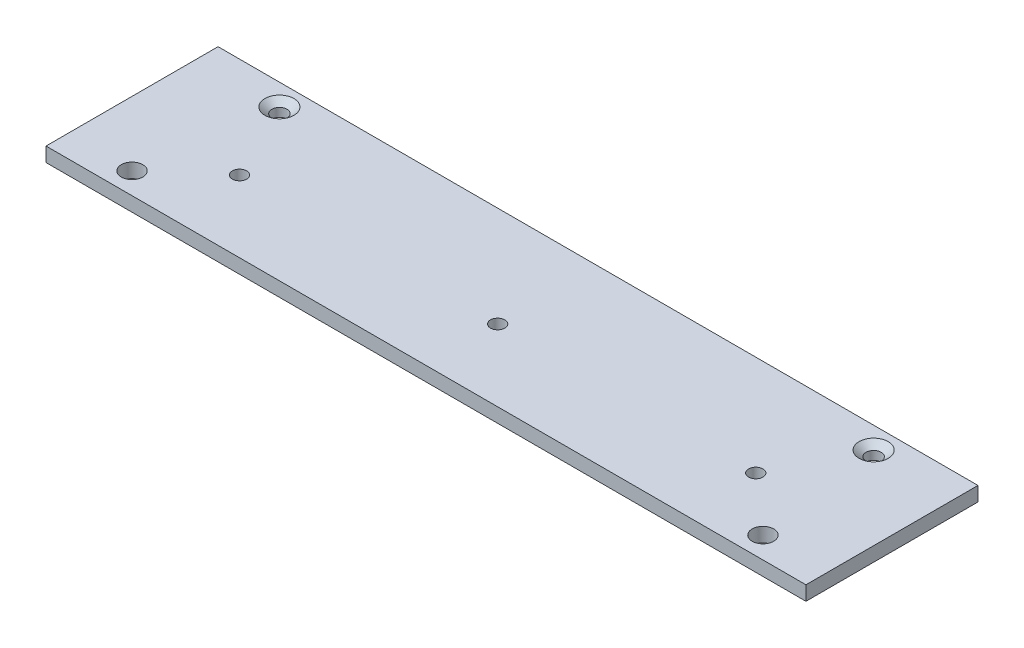
ISO-10303-21;
HEADER;
FILE_DESCRIPTION(('STEP AP214'),'2;1');
FILE_NAME('part.step','',(''),(''),'','','');
FILE_SCHEMA(('AUTOMOTIVE_DESIGN { 1 0 10303 214 1 1 1 1 }'));
ENDSEC;
DATA;
#1=APPLICATION_CONTEXT('core data for automotive mechanical design processes');
#2=APPLICATION_PROTOCOL_DEFINITION('international standard','automotive_design',2000,#1);
#3=PRODUCT_CONTEXT('',#1,'mechanical');
#4=PRODUCT('Part','Part','',(#3));
#5=PRODUCT_RELATED_PRODUCT_CATEGORY('part','',(#4));
#6=PRODUCT_DEFINITION_FORMATION('','',#4);
#7=PRODUCT_DEFINITION_CONTEXT('part definition',#1,'design');
#8=PRODUCT_DEFINITION('design','',#6,#7);
#9=PRODUCT_DEFINITION_SHAPE('','',#8);
#10=(LENGTH_UNIT() NAMED_UNIT(*) SI_UNIT(.MILLI.,.METRE.));
#11=(NAMED_UNIT(*) PLANE_ANGLE_UNIT() SI_UNIT($,.RADIAN.));
#12=(NAMED_UNIT(*) SI_UNIT($,.STERADIAN.) SOLID_ANGLE_UNIT());
#13=UNCERTAINTY_MEASURE_WITH_UNIT(LENGTH_MEASURE(1.E-05),#10,'distance_accuracy_value','');
#14=(GEOMETRIC_REPRESENTATION_CONTEXT(3) GLOBAL_UNCERTAINTY_ASSIGNED_CONTEXT((#13)) GLOBAL_UNIT_ASSIGNED_CONTEXT((#10,
#11,#12)) REPRESENTATION_CONTEXT('',''));
#15=CARTESIAN_POINT('',(0.,0.,0.));
#16=DIRECTION('',(0.,0.,1.));
#17=DIRECTION('',(1.,0.,0.));
#18=AXIS2_PLACEMENT_3D('',#15,#16,#17);
#19=CARTESIAN_POINT('',(0.,3.175,0.));
#20=DIRECTION('',(0.,1.,0.));
#21=DIRECTION('',(0.,0.,1.));
#22=AXIS2_PLACEMENT_3D('',#19,#20,#21);
#23=PLANE('',#22);
#24=CARTESIAN_POINT('',(-114.3,3.175,-6.35000000000002));
#25=DIRECTION('',(0.,1.,0.));
#26=DIRECTION('',(0.,0.,1.));
#27=AXIS2_PLACEMENT_3D('',#24,#25,#26);
#28=CIRCLE('',#27,3.175);
#29=CARTESIAN_POINT('',(-114.3,3.175,-3.17500000000002));
#30=VERTEX_POINT('',#29);
#31=EDGE_CURVE('E143',#30,#30,#28,.T.);
#32=ORIENTED_EDGE('',*,*,#31,.F.);
#33=EDGE_LOOP('',(#32));
#34=FACE_BOUND('',#33,.T.);
#35=CARTESIAN_POINT('',(114.3,3.175,-6.35000000000002));
#36=DIRECTION('',(0.,1.,0.));
#37=DIRECTION('',(0.,0.,1.));
#38=AXIS2_PLACEMENT_3D('',#35,#36,#37);
#39=CIRCLE('',#38,3.175);
#40=CARTESIAN_POINT('',(114.3,3.175,-3.17500000000002));
#41=VERTEX_POINT('',#40);
#42=EDGE_CURVE('E146',#41,#41,#39,.T.);
#43=ORIENTED_EDGE('',*,*,#42,.F.);
#44=EDGE_LOOP('',(#43));
#45=FACE_BOUND('',#44,.T.);
#46=CARTESIAN_POINT('',(0.,3.175,-6.35000000000002));
#47=DIRECTION('',(0.,1.,0.));
#48=DIRECTION('',(0.,0.,1.));
#49=AXIS2_PLACEMENT_3D('',#46,#47,#48);
#50=CIRCLE('',#49,3.175);
#51=CARTESIAN_POINT('',(0.,3.175,-3.17500000000002));
#52=VERTEX_POINT('',#51);
#53=EDGE_CURVE('E149',#52,#52,#50,.T.);
#54=ORIENTED_EDGE('',*,*,#53,.F.);
#55=EDGE_LOOP('',(#54));
#56=FACE_BOUND('',#55,.T.);
#57=CARTESIAN_POINT('',(-131.572,3.175,-41.2750000000001));
#58=DIRECTION('',(0.,1.,0.));
#59=DIRECTION('',(0.,0.,1.));
#60=AXIS2_PLACEMENT_3D('',#57,#58,#59);
#61=CIRCLE('',#60,6.4389);
#62=CARTESIAN_POINT('',(-131.572,3.175,-34.8361000000001));
#63=VERTEX_POINT('',#62);
#64=EDGE_CURVE('E140',#63,#63,#61,.T.);
#65=ORIENTED_EDGE('',*,*,#64,.F.);
#66=EDGE_LOOP('',(#65));
#67=FACE_BOUND('',#66,.T.);
#68=CARTESIAN_POINT('',(131.572,3.175,-41.2750000000001));
#69=DIRECTION('',(0.,1.,0.));
#70=DIRECTION('',(0.,0.,1.));
#71=AXIS2_PLACEMENT_3D('',#68,#69,#70);
#72=CIRCLE('',#71,6.4389);
#73=CARTESIAN_POINT('',(131.572,3.175,-34.8361000000001));
#74=VERTEX_POINT('',#73);
#75=EDGE_CURVE('E131',#74,#74,#72,.T.);
#76=ORIENTED_EDGE('',*,*,#75,.F.);
#77=EDGE_LOOP('',(#76));
#78=FACE_BOUND('',#77,.T.);
#79=CARTESIAN_POINT('',(-139.7,3.175,15.875));
#80=DIRECTION('',(0.,1.,0.));
#81=DIRECTION('',(0.,0.,1.));
#82=AXIS2_PLACEMENT_3D('',#79,#80,#81);
#83=CIRCLE('',#82,4.76250000000001);
#84=CARTESIAN_POINT('',(-139.7,3.175,20.6375));
#85=VERTEX_POINT('',#84);
#86=EDGE_CURVE('E102',#85,#85,#83,.T.);
#87=ORIENTED_EDGE('',*,*,#86,.F.);
#88=EDGE_LOOP('',(#87));
#89=FACE_BOUND('',#88,.T.);
#90=DIRECTION('',(0.,0.,-1.));
#91=VECTOR('',#90,1.);
#92=CARTESIAN_POINT('',(168.275,3.175,-50.8));
#93=LINE('',#92,#91);
#94=CARTESIAN_POINT('',(168.275,3.175,25.4));
#95=VERTEX_POINT('',#94);
#96=CARTESIAN_POINT('',(168.275,3.175,-50.8));
#97=VERTEX_POINT('',#96);
#98=EDGE_CURVE('E87',#95,#97,#93,.T.);
#99=ORIENTED_EDGE('',*,*,#98,.T.);
#100=DIRECTION('',(-1.,0.,0.));
#101=VECTOR('',#100,1.);
#102=CARTESIAN_POINT('',(-168.275,3.175,-50.8));
#103=LINE('',#102,#101);
#104=CARTESIAN_POINT('',(-168.275,3.175,-50.8));
#105=VERTEX_POINT('',#104);
#106=EDGE_CURVE('E82',#97,#105,#103,.T.);
#107=ORIENTED_EDGE('',*,*,#106,.T.);
#108=DIRECTION('',(0.,0.,1.));
#109=VECTOR('',#108,1.);
#110=CARTESIAN_POINT('',(-168.275,3.175,-50.8));
#111=LINE('',#110,#109);
#112=CARTESIAN_POINT('',(-168.275,3.175,25.4));
#113=VERTEX_POINT('',#112);
#114=EDGE_CURVE('E85',#105,#113,#111,.T.);
#115=ORIENTED_EDGE('',*,*,#114,.T.);
#116=DIRECTION('',(1.,0.,0.));
#117=VECTOR('',#116,1.);
#118=CARTESIAN_POINT('',(-168.275,3.175,25.4));
#119=LINE('',#118,#117);
#120=EDGE_CURVE('E52',#113,#95,#119,.T.);
#121=ORIENTED_EDGE('',*,*,#120,.T.);
#122=EDGE_LOOP('',(#99,#107,#115,#121));
#123=FACE_BOUND('',#122,.T.);
#124=CARTESIAN_POINT('',(139.7,3.175,15.875));
#125=DIRECTION('',(0.,1.,0.));
#126=DIRECTION('',(0.,0.,1.));
#127=AXIS2_PLACEMENT_3D('',#124,#125,#126);
#128=CIRCLE('',#127,4.76250000000001);
#129=CARTESIAN_POINT('',(139.7,3.175,20.6375));
#130=VERTEX_POINT('',#129);
#131=EDGE_CURVE('E117',#130,#130,#128,.T.);
#132=ORIENTED_EDGE('',*,*,#131,.F.);
#133=EDGE_LOOP('',(#132));
#134=FACE_BOUND('',#133,.T.);
#135=ADVANCED_FACE('F35',(#34,#45,#56,#67,#78,#89,#123,#134),#23,.T.);
#136=CARTESIAN_POINT('',(0.,-3.175,0.));
#137=DIRECTION('',(0.,1.,0.));
#138=DIRECTION('',(0.,0.,1.));
#139=AXIS2_PLACEMENT_3D('',#136,#137,#138);
#140=PLANE('',#139);
#141=CARTESIAN_POINT('',(-114.3,-3.17500000000004,-6.35000000000002));
#142=DIRECTION('',(0.,1.,0.));
#143=DIRECTION('',(0.,0.,1.));
#144=AXIS2_PLACEMENT_3D('',#141,#142,#143);
#145=CIRCLE('',#144,3.175);
#146=CARTESIAN_POINT('',(-114.3,-3.17500000000004,-3.17500000000002));
#147=VERTEX_POINT('',#146);
#148=EDGE_CURVE('E152',#147,#147,#145,.T.);
#149=ORIENTED_EDGE('',*,*,#148,.T.);
#150=EDGE_LOOP('',(#149));
#151=FACE_BOUND('',#150,.T.);
#152=CARTESIAN_POINT('',(114.3,-3.17500000000004,-6.35000000000002));
#153=DIRECTION('',(0.,1.,0.));
#154=DIRECTION('',(0.,0.,1.));
#155=AXIS2_PLACEMENT_3D('',#152,#153,#154);
#156=CIRCLE('',#155,3.175);
#157=CARTESIAN_POINT('',(114.3,-3.17500000000004,-3.17500000000002));
#158=VERTEX_POINT('',#157);
#159=EDGE_CURVE('E156',#158,#158,#156,.T.);
#160=ORIENTED_EDGE('',*,*,#159,.T.);
#161=EDGE_LOOP('',(#160));
#162=FACE_BOUND('',#161,.T.);
#163=CARTESIAN_POINT('',(0.,-3.17500000000004,-6.35000000000002));
#164=DIRECTION('',(0.,1.,0.));
#165=DIRECTION('',(0.,0.,1.));
#166=AXIS2_PLACEMENT_3D('',#163,#164,#165);
#167=CIRCLE('',#166,3.175);
#168=CARTESIAN_POINT('',(0.,-3.17500000000004,-3.17500000000002));
#169=VERTEX_POINT('',#168);
#170=EDGE_CURVE('E153',#169,#169,#167,.T.);
#171=ORIENTED_EDGE('',*,*,#170,.T.);
#172=EDGE_LOOP('',(#171));
#173=FACE_BOUND('',#172,.T.);
#174=CARTESIAN_POINT('',(-131.572,-3.17500000000004,-41.2750000000001));
#175=DIRECTION('',(0.,1.,0.));
#176=DIRECTION('',(0.,0.,1.));
#177=AXIS2_PLACEMENT_3D('',#174,#175,#176);
#178=CIRCLE('',#177,3.3782);
#179=CARTESIAN_POINT('',(-131.572,-3.17500000000004,-37.8968000000001));
#180=VERTEX_POINT('',#179);
#181=EDGE_CURVE('E134',#180,#180,#178,.T.);
#182=ORIENTED_EDGE('',*,*,#181,.T.);
#183=EDGE_LOOP('',(#182));
#184=FACE_BOUND('',#183,.T.);
#185=CARTESIAN_POINT('',(131.572,-3.17500000000004,-41.2750000000001));
#186=DIRECTION('',(0.,1.,0.));
#187=DIRECTION('',(0.,0.,1.));
#188=AXIS2_PLACEMENT_3D('',#185,#186,#187);
#189=CIRCLE('',#188,3.3782);
#190=CARTESIAN_POINT('',(131.572,-3.17500000000004,-37.8968000000001));
#191=VERTEX_POINT('',#190);
#192=EDGE_CURVE('E123',#191,#191,#189,.T.);
#193=ORIENTED_EDGE('',*,*,#192,.T.);
#194=EDGE_LOOP('',(#193));
#195=FACE_BOUND('',#194,.T.);
#196=DIRECTION('',(0.,0.,-1.));
#197=VECTOR('',#196,1.);
#198=CARTESIAN_POINT('',(168.275,-3.175,-50.8));
#199=LINE('',#198,#197);
#200=CARTESIAN_POINT('',(168.275,-3.175,25.4));
#201=VERTEX_POINT('',#200);
#202=CARTESIAN_POINT('',(168.275,-3.175,-50.8));
#203=VERTEX_POINT('',#202);
#204=EDGE_CURVE('E99',#201,#203,#199,.T.);
#205=ORIENTED_EDGE('',*,*,#204,.F.);
#206=DIRECTION('',(1.,0.,0.));
#207=VECTOR('',#206,1.);
#208=CARTESIAN_POINT('',(-168.275,-3.175,25.4));
#209=LINE('',#208,#207);
#210=CARTESIAN_POINT('',(-168.275,-3.175,25.4));
#211=VERTEX_POINT('',#210);
#212=EDGE_CURVE('E75',#211,#201,#209,.T.);
#213=ORIENTED_EDGE('',*,*,#212,.F.);
#214=DIRECTION('',(0.,0.,1.));
#215=VECTOR('',#214,1.);
#216=CARTESIAN_POINT('',(-168.275,-3.175,-50.8));
#217=LINE('',#216,#215);
#218=CARTESIAN_POINT('',(-168.275,-3.175,-50.8));
#219=VERTEX_POINT('',#218);
#220=EDGE_CURVE('E69',#219,#211,#217,.T.);
#221=ORIENTED_EDGE('',*,*,#220,.F.);
#222=DIRECTION('',(-1.,0.,0.));
#223=VECTOR('',#222,1.);
#224=CARTESIAN_POINT('',(-168.275,-3.175,-50.8));
#225=LINE('',#224,#223);
#226=EDGE_CURVE('E91',#203,#219,#225,.T.);
#227=ORIENTED_EDGE('',*,*,#226,.F.);
#228=EDGE_LOOP('',(#205,#213,#221,#227));
#229=FACE_BOUND('',#228,.T.);
#230=CARTESIAN_POINT('',(-139.7,-3.175,15.875));
#231=DIRECTION('',(0.,1.,0.));
#232=DIRECTION('',(0.,0.,1.));
#233=AXIS2_PLACEMENT_3D('',#230,#231,#232);
#234=CIRCLE('',#233,4.76250000000001);
#235=CARTESIAN_POINT('',(-139.7,-3.175,20.6375));
#236=VERTEX_POINT('',#235);
#237=EDGE_CURVE('E114',#236,#236,#234,.T.);
#238=ORIENTED_EDGE('',*,*,#237,.T.);
#239=EDGE_LOOP('',(#238));
#240=FACE_BOUND('',#239,.T.);
#241=CARTESIAN_POINT('',(139.7,-3.175,15.875));
#242=DIRECTION('',(0.,1.,0.));
#243=DIRECTION('',(0.,0.,1.));
#244=AXIS2_PLACEMENT_3D('',#241,#242,#243);
#245=CIRCLE('',#244,4.76250000000001);
#246=CARTESIAN_POINT('',(139.7,-3.175,20.6375));
#247=VERTEX_POINT('',#246);
#248=EDGE_CURVE('E120',#247,#247,#245,.T.);
#249=ORIENTED_EDGE('',*,*,#248,.T.);
#250=EDGE_LOOP('',(#249));
#251=FACE_BOUND('',#250,.T.);
#252=ADVANCED_FACE('F110',(#151,#162,#173,#184,#195,#229,#240,#251),#140,.F.);
#253=CARTESIAN_POINT('',(168.275,3.175,-50.8));
#254=DIRECTION('',(-1.,0.,0.));
#255=DIRECTION('',(0.,0.,1.));
#256=AXIS2_PLACEMENT_3D('',#253,#254,#255);
#257=PLANE('',#256);
#258=ORIENTED_EDGE('',*,*,#204,.T.);
#259=DIRECTION('',(0.,-1.,0.));
#260=VECTOR('',#259,1.);
#261=CARTESIAN_POINT('',(168.275,3.175,-50.8));
#262=LINE('',#261,#260);
#263=EDGE_CURVE('E11',#97,#203,#262,.T.);
#264=ORIENTED_EDGE('',*,*,#263,.F.);
#265=ORIENTED_EDGE('',*,*,#98,.F.);
#266=DIRECTION('',(0.,-1.,0.));
#267=VECTOR('',#266,1.);
#268=CARTESIAN_POINT('',(168.275,3.175,25.4));
#269=LINE('',#268,#267);
#270=EDGE_CURVE('E95',#95,#201,#269,.T.);
#271=ORIENTED_EDGE('',*,*,#270,.T.);
#272=EDGE_LOOP('',(#258,#264,#265,#271));
#273=FACE_BOUND('',#272,.T.);
#274=ADVANCED_FACE('F37',(#273),#257,.F.);
#275=CARTESIAN_POINT('',(-168.275,3.175,-50.8));
#276=DIRECTION('',(0.,0.,1.));
#277=DIRECTION('',(1.,0.,0.));
#278=AXIS2_PLACEMENT_3D('',#275,#276,#277);
#279=PLANE('',#278);
#280=ORIENTED_EDGE('',*,*,#226,.T.);
#281=DIRECTION('',(0.,-1.,0.));
#282=VECTOR('',#281,1.);
#283=CARTESIAN_POINT('',(-168.275,3.175,-50.8));
#284=LINE('',#283,#282);
#285=EDGE_CURVE('E44',#105,#219,#284,.T.);
#286=ORIENTED_EDGE('',*,*,#285,.F.);
#287=ORIENTED_EDGE('',*,*,#106,.F.);
#288=ORIENTED_EDGE('',*,*,#263,.T.);
#289=EDGE_LOOP('',(#280,#286,#287,#288));
#290=FACE_BOUND('',#289,.T.);
#291=ADVANCED_FACE('F90',(#290),#279,.F.);
#292=CARTESIAN_POINT('',(-168.275,3.175,-50.8));
#293=DIRECTION('',(1.,0.,0.));
#294=DIRECTION('',(0.,0.,-1.));
#295=AXIS2_PLACEMENT_3D('',#292,#293,#294);
#296=PLANE('',#295);
#297=ORIENTED_EDGE('',*,*,#220,.T.);
#298=DIRECTION('',(0.,-1.,0.));
#299=VECTOR('',#298,1.);
#300=CARTESIAN_POINT('',(-168.275,3.175,25.4));
#301=LINE('',#300,#299);
#302=EDGE_CURVE('E92',#113,#211,#301,.T.);
#303=ORIENTED_EDGE('',*,*,#302,.F.);
#304=ORIENTED_EDGE('',*,*,#114,.F.);
#305=ORIENTED_EDGE('',*,*,#285,.T.);
#306=EDGE_LOOP('',(#297,#303,#304,#305));
#307=FACE_BOUND('',#306,.T.);
#308=ADVANCED_FACE('F93',(#307),#296,.F.);
#309=CARTESIAN_POINT('',(-168.275,3.175,25.4));
#310=DIRECTION('',(0.,0.,-1.));
#311=DIRECTION('',(-1.,0.,0.));
#312=AXIS2_PLACEMENT_3D('',#309,#310,#311);
#313=PLANE('',#312);
#314=ORIENTED_EDGE('',*,*,#212,.T.);
#315=ORIENTED_EDGE('',*,*,#270,.F.);
#316=ORIENTED_EDGE('',*,*,#120,.F.);
#317=ORIENTED_EDGE('',*,*,#302,.T.);
#318=EDGE_LOOP('',(#314,#315,#316,#317));
#319=FACE_BOUND('',#318,.T.);
#320=ADVANCED_FACE('F107',(#319),#313,.F.);
#321=CARTESIAN_POINT('',(-139.7,3.175,15.875));
#322=DIRECTION('',(0.,-1.,0.));
#323=DIRECTION('',(0.,0.,-1.));
#324=AXIS2_PLACEMENT_3D('',#321,#322,#323);
#325=CYLINDRICAL_SURFACE('',#324,4.76250000000001);
#326=ORIENTED_EDGE('',*,*,#86,.T.);
#327=EDGE_LOOP('',(#326));
#328=FACE_BOUND('',#327,.T.);
#329=ORIENTED_EDGE('',*,*,#237,.F.);
#330=EDGE_LOOP('',(#329));
#331=FACE_BOUND('',#330,.T.);
#332=ADVANCED_FACE('F185',(#328,#331),#325,.F.);
#333=CARTESIAN_POINT('',(139.7,3.175,15.875));
#334=DIRECTION('',(0.,-1.,0.));
#335=DIRECTION('',(0.,0.,-1.));
#336=AXIS2_PLACEMENT_3D('',#333,#334,#335);
#337=CYLINDRICAL_SURFACE('',#336,4.76250000000001);
#338=ORIENTED_EDGE('',*,*,#131,.T.);
#339=EDGE_LOOP('',(#338));
#340=FACE_BOUND('',#339,.T.);
#341=ORIENTED_EDGE('',*,*,#248,.F.);
#342=EDGE_LOOP('',(#341));
#343=FACE_BOUND('',#342,.T.);
#344=ADVANCED_FACE('F255',(#340,#343),#337,.F.);
#345=CARTESIAN_POINT('',(131.572,3.175,-41.2750000000001));
#346=DIRECTION('',(0.,1.,0.));
#347=DIRECTION('',(0.,0.,1.));
#348=AXIS2_PLACEMENT_3D('',#345,#346,#347);
#349=CYLINDRICAL_SURFACE('',#348,3.3782);
#350=ORIENTED_EDGE('',*,*,#192,.F.);
#351=EDGE_LOOP('',(#350));
#352=FACE_BOUND('',#351,.T.);
#353=CARTESIAN_POINT('',(131.572,0.606767758855683,-41.2750000000001));
#354=DIRECTION('',(0.,1.,0.));
#355=DIRECTION('',(0.,0.,1.));
#356=AXIS2_PLACEMENT_3D('',#353,#354,#355);
#357=CIRCLE('',#356,3.3782);
#358=CARTESIAN_POINT('',(131.572,0.606767758855683,-37.8968000000001));
#359=VERTEX_POINT('',#358);
#360=EDGE_CURVE('E128',#359,#359,#357,.T.);
#361=ORIENTED_EDGE('',*,*,#360,.T.);
#362=EDGE_LOOP('',(#361));
#363=FACE_BOUND('',#362,.T.);
#364=ADVANCED_FACE('F247',(#352,#363),#349,.F.);
#365=CARTESIAN_POINT('',(131.572,3.175,-41.2750000000001));
#366=DIRECTION('',(0.,1.,0.));
#367=DIRECTION('',(0.,0.,1.));
#368=AXIS2_PLACEMENT_3D('',#365,#366,#367);
#369=CONICAL_SURFACE('',#368,6.4389,0.872664625997162);
#370=ORIENTED_EDGE('',*,*,#360,.F.);
#371=EDGE_LOOP('',(#370));
#372=FACE_BOUND('',#371,.T.);
#373=ORIENTED_EDGE('',*,*,#75,.T.);
#374=EDGE_LOOP('',(#373));
#375=FACE_BOUND('',#374,.T.);
#376=ADVANCED_FACE('F239',(#372,#375),#369,.F.);
#377=CARTESIAN_POINT('',(-131.572,3.175,-41.2750000000001));
#378=DIRECTION('',(0.,1.,0.));
#379=DIRECTION('',(0.,0.,1.));
#380=AXIS2_PLACEMENT_3D('',#377,#378,#379);
#381=CYLINDRICAL_SURFACE('',#380,3.3782);
#382=ORIENTED_EDGE('',*,*,#181,.F.);
#383=EDGE_LOOP('',(#382));
#384=FACE_BOUND('',#383,.T.);
#385=CARTESIAN_POINT('',(-131.572,0.606767758855683,-41.2750000000001));
#386=DIRECTION('',(0.,1.,0.));
#387=DIRECTION('',(0.,0.,1.));
#388=AXIS2_PLACEMENT_3D('',#385,#386,#387);
#389=CIRCLE('',#388,3.3782);
#390=CARTESIAN_POINT('',(-131.572,0.606767758855683,-37.8968000000001));
#391=VERTEX_POINT('',#390);
#392=EDGE_CURVE('E137',#391,#391,#389,.T.);
#393=ORIENTED_EDGE('',*,*,#392,.T.);
#394=EDGE_LOOP('',(#393));
#395=FACE_BOUND('',#394,.T.);
#396=ADVANCED_FACE('F232',(#384,#395),#381,.F.);
#397=CARTESIAN_POINT('',(-131.572,3.175,-41.2750000000001));
#398=DIRECTION('',(0.,1.,0.));
#399=DIRECTION('',(0.,0.,1.));
#400=AXIS2_PLACEMENT_3D('',#397,#398,#399);
#401=CONICAL_SURFACE('',#400,6.4389,0.872664625997162);
#402=ORIENTED_EDGE('',*,*,#392,.F.);
#403=EDGE_LOOP('',(#402));
#404=FACE_BOUND('',#403,.T.);
#405=ORIENTED_EDGE('',*,*,#64,.T.);
#406=EDGE_LOOP('',(#405));
#407=FACE_BOUND('',#406,.T.);
#408=ADVANCED_FACE('F213',(#404,#407),#401,.F.);
#409=CARTESIAN_POINT('',(0.,-3.17500000000004,-6.35000000000002));
#410=DIRECTION('',(0.,1.,0.));
#411=DIRECTION('',(0.,0.,1.));
#412=AXIS2_PLACEMENT_3D('',#409,#410,#411);
#413=CYLINDRICAL_SURFACE('',#412,3.175);
#414=ORIENTED_EDGE('',*,*,#53,.T.);
#415=EDGE_LOOP('',(#414));
#416=FACE_BOUND('',#415,.T.);
#417=ORIENTED_EDGE('',*,*,#170,.F.);
#418=EDGE_LOOP('',(#417));
#419=FACE_BOUND('',#418,.T.);
#420=ADVANCED_FACE('F172',(#416,#419),#413,.F.);
#421=CARTESIAN_POINT('',(114.3,-3.17500000000004,-6.35000000000002));
#422=DIRECTION('',(0.,1.,0.));
#423=DIRECTION('',(0.,0.,1.));
#424=AXIS2_PLACEMENT_3D('',#421,#422,#423);
#425=CYLINDRICAL_SURFACE('',#424,3.175);
#426=ORIENTED_EDGE('',*,*,#42,.T.);
#427=EDGE_LOOP('',(#426));
#428=FACE_BOUND('',#427,.T.);
#429=ORIENTED_EDGE('',*,*,#159,.F.);
#430=EDGE_LOOP('',(#429));
#431=FACE_BOUND('',#430,.T.);
#432=ADVANCED_FACE('F166',(#428,#431),#425,.F.);
#433=CARTESIAN_POINT('',(-114.3,-3.17500000000004,-6.35000000000002));
#434=DIRECTION('',(0.,1.,0.));
#435=DIRECTION('',(0.,0.,1.));
#436=AXIS2_PLACEMENT_3D('',#433,#434,#435);
#437=CYLINDRICAL_SURFACE('',#436,3.175);
#438=ORIENTED_EDGE('',*,*,#31,.T.);
#439=EDGE_LOOP('',(#438));
#440=FACE_BOUND('',#439,.T.);
#441=ORIENTED_EDGE('',*,*,#148,.F.);
#442=EDGE_LOOP('',(#441));
#443=FACE_BOUND('',#442,.T.);
#444=ADVANCED_FACE('F164',(#440,#443),#437,.F.);
#445=CLOSED_SHELL('',(#135,#252,#274,#291,#308,#320,#332,#344,#364,#376,#396,#408,#420,#432,#444));
#446=MANIFOLD_SOLID_BREP('B2',#445);
#447=ADVANCED_BREP_SHAPE_REPRESENTATION('',(#18,#446),#14);
#448=SHAPE_DEFINITION_REPRESENTATION(#9,#447);
ENDSEC;
END-ISO-10303-21;
